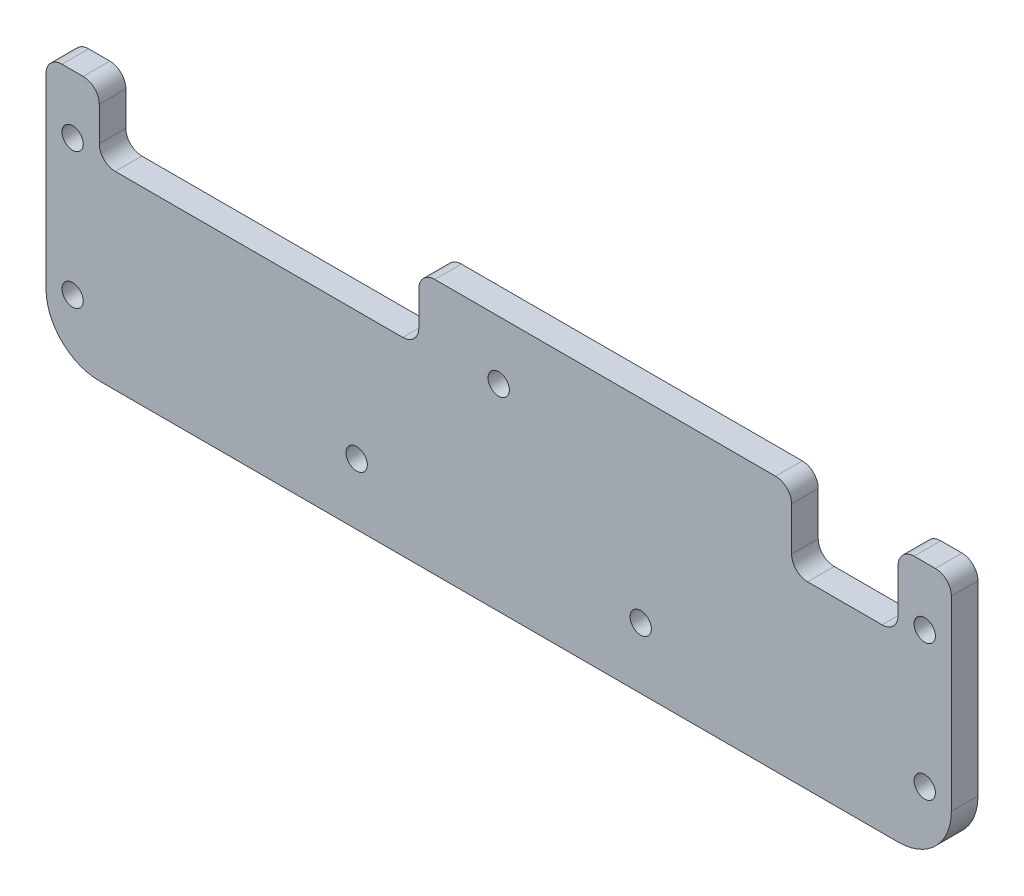
ISO-10303-21;
HEADER;
FILE_DESCRIPTION(('STEP AP214'),'2;1');
FILE_NAME('part.step','',(''),(''),'','','');
FILE_SCHEMA(('AUTOMOTIVE_DESIGN { 1 0 10303 214 1 1 1 1 }'));
ENDSEC;
DATA;
#1=APPLICATION_CONTEXT('core data for automotive mechanical design processes');
#2=APPLICATION_PROTOCOL_DEFINITION('international standard','automotive_design',2000,#1);
#3=PRODUCT_CONTEXT('',#1,'mechanical');
#4=PRODUCT('Part','Part','',(#3));
#5=PRODUCT_RELATED_PRODUCT_CATEGORY('part','',(#4));
#6=PRODUCT_DEFINITION_FORMATION('','',#4);
#7=PRODUCT_DEFINITION_CONTEXT('part definition',#1,'design');
#8=PRODUCT_DEFINITION('design','',#6,#7);
#9=PRODUCT_DEFINITION_SHAPE('','',#8);
#10=(LENGTH_UNIT() NAMED_UNIT(*) SI_UNIT(.MILLI.,.METRE.));
#11=(NAMED_UNIT(*) PLANE_ANGLE_UNIT() SI_UNIT($,.RADIAN.));
#12=(NAMED_UNIT(*) SI_UNIT($,.STERADIAN.) SOLID_ANGLE_UNIT());
#13=UNCERTAINTY_MEASURE_WITH_UNIT(LENGTH_MEASURE(1.E-05),#10,'distance_accuracy_value','');
#14=(GEOMETRIC_REPRESENTATION_CONTEXT(3) GLOBAL_UNCERTAINTY_ASSIGNED_CONTEXT((#13)) GLOBAL_UNIT_ASSIGNED_CONTEXT((#10,
#11,#12)) REPRESENTATION_CONTEXT('',''));
#15=CARTESIAN_POINT('',(0.,0.,0.));
#16=DIRECTION('',(0.,0.,1.));
#17=DIRECTION('',(1.,0.,0.));
#18=AXIS2_PLACEMENT_3D('',#15,#16,#17);
#19=CARTESIAN_POINT('',(-75.,-38.,5.));
#20=DIRECTION('',(0.,0.,-1.));
#21=DIRECTION('',(-1.,0.,0.));
#22=AXIS2_PLACEMENT_3D('',#19,#20,#21);
#23=PLANE('',#22);
#24=CARTESIAN_POINT('',(-26.6666666666667,-36.5,5.));
#25=DIRECTION('',(0.,0.,1.));
#26=DIRECTION('',(1.,0.,0.));
#27=AXIS2_PLACEMENT_3D('',#24,#25,#26);
#28=CIRCLE('',#27,2.00000000000001);
#29=CARTESIAN_POINT('',(-24.6666666666667,-36.5,5.));
#30=VERTEX_POINT('',#29);
#31=EDGE_CURVE('E380',#30,#30,#28,.T.);
#32=ORIENTED_EDGE('',*,*,#31,.F.);
#33=EDGE_LOOP('',(#32));
#34=FACE_BOUND('',#33,.T.);
#35=CARTESIAN_POINT('',(-80.,-11.,5.));
#36=DIRECTION('',(0.,0.,1.));
#37=DIRECTION('',(1.,0.,0.));
#38=AXIS2_PLACEMENT_3D('',#35,#36,#37);
#39=CIRCLE('',#38,2.);
#40=CARTESIAN_POINT('',(-78.,-11.,5.));
#41=VERTEX_POINT('',#40);
#42=EDGE_CURVE('E374',#41,#41,#39,.T.);
#43=ORIENTED_EDGE('',*,*,#42,.F.);
#44=EDGE_LOOP('',(#43));
#45=FACE_BOUND('',#44,.T.);
#46=CARTESIAN_POINT('',(0.,-11.,5.));
#47=DIRECTION('',(0.,0.,1.));
#48=DIRECTION('',(1.,0.,0.));
#49=AXIS2_PLACEMENT_3D('',#46,#47,#48);
#50=CIRCLE('',#49,2.);
#51=CARTESIAN_POINT('',(2.00000000000001,-11.,5.));
#52=VERTEX_POINT('',#51);
#53=EDGE_CURVE('E368',#52,#52,#50,.T.);
#54=ORIENTED_EDGE('',*,*,#53,.F.);
#55=EDGE_LOOP('',(#54));
#56=FACE_BOUND('',#55,.T.);
#57=CARTESIAN_POINT('',(80.,-11.,5.));
#58=DIRECTION('',(0.,0.,1.));
#59=DIRECTION('',(1.,0.,0.));
#60=AXIS2_PLACEMENT_3D('',#57,#58,#59);
#61=CIRCLE('',#60,2.);
#62=CARTESIAN_POINT('',(82.,-11.,5.));
#63=VERTEX_POINT('',#62);
#64=EDGE_CURVE('E362',#63,#63,#61,.T.);
#65=ORIENTED_EDGE('',*,*,#64,.F.);
#66=EDGE_LOOP('',(#65));
#67=FACE_BOUND('',#66,.T.);
#68=CARTESIAN_POINT('',(-80.,-36.5,5.));
#69=DIRECTION('',(0.,0.,1.));
#70=DIRECTION('',(1.,0.,0.));
#71=AXIS2_PLACEMENT_3D('',#68,#69,#70);
#72=CIRCLE('',#71,2.);
#73=CARTESIAN_POINT('',(-78.,-36.5,5.));
#74=VERTEX_POINT('',#73);
#75=EDGE_CURVE('E356',#74,#74,#72,.T.);
#76=ORIENTED_EDGE('',*,*,#75,.F.);
#77=EDGE_LOOP('',(#76));
#78=FACE_BOUND('',#77,.T.);
#79=CARTESIAN_POINT('',(26.6666666666667,-36.5,5.));
#80=DIRECTION('',(0.,0.,1.));
#81=DIRECTION('',(-1.,0.,0.));
#82=AXIS2_PLACEMENT_3D('',#79,#80,#81);
#83=CIRCLE('',#82,2.00000000000001);
#84=CARTESIAN_POINT('',(24.6666666666667,-36.5,5.));
#85=VERTEX_POINT('',#84);
#86=EDGE_CURVE('E350',#85,#85,#83,.T.);
#87=ORIENTED_EDGE('',*,*,#86,.F.);
#88=EDGE_LOOP('',(#87));
#89=FACE_BOUND('',#88,.T.);
#90=CARTESIAN_POINT('',(80.,-36.5,5.));
#91=DIRECTION('',(0.,0.,1.));
#92=DIRECTION('',(1.,0.,0.));
#93=AXIS2_PLACEMENT_3D('',#90,#91,#92);
#94=CIRCLE('',#93,2.);
#95=CARTESIAN_POINT('',(82.,-36.5,5.));
#96=VERTEX_POINT('',#95);
#97=EDGE_CURVE('E341',#96,#96,#94,.T.);
#98=ORIENTED_EDGE('',*,*,#97,.F.);
#99=EDGE_LOOP('',(#98));
#100=FACE_BOUND('',#99,.T.);
#101=DIRECTION('',(0.,-1.,0.));
#102=VECTOR('',#101,1.);
#103=CARTESIAN_POINT('',(55.,-38.,5.));
#104=LINE('',#103,#102);
#105=CARTESIAN_POINT('',(55.,-2.99999999999997,5.));
#106=VERTEX_POINT('',#105);
#107=CARTESIAN_POINT('',(55.,-11.1694329332956,5.));
#108=VERTEX_POINT('',#107);
#109=EDGE_CURVE('E760',#106,#108,#104,.T.);
#110=ORIENTED_EDGE('',*,*,#109,.F.);
#111=CARTESIAN_POINT('',(52.,-2.99999999999997,5.));
#112=DIRECTION('',(0.,0.,-1.));
#113=DIRECTION('',(-1.,0.,0.));
#114=AXIS2_PLACEMENT_3D('',#111,#112,#113);
#115=CIRCLE('',#114,3.);
#116=CARTESIAN_POINT('',(52.,0.,5.));
#117=VERTEX_POINT('',#116);
#118=EDGE_CURVE('E249',#106,#117,#115,.F.);
#119=ORIENTED_EDGE('',*,*,#118,.T.);
#120=DIRECTION('',(-1.,0.,0.));
#121=VECTOR('',#120,1.);
#122=CARTESIAN_POINT('',(-85.,0.,5.));
#123=LINE('',#122,#121);
#124=CARTESIAN_POINT('',(-12.,0.,5.));
#125=VERTEX_POINT('',#124);
#126=EDGE_CURVE('E392',#117,#125,#123,.T.);
#127=ORIENTED_EDGE('',*,*,#126,.T.);
#128=CARTESIAN_POINT('',(-12.,-2.99999999999997,5.));
#129=DIRECTION('',(0.,0.,-1.));
#130=DIRECTION('',(-1.,0.,0.));
#131=AXIS2_PLACEMENT_3D('',#128,#129,#130);
#132=CIRCLE('',#131,3.);
#133=CARTESIAN_POINT('',(-15.,-2.99999999999998,5.));
#134=VERTEX_POINT('',#133);
#135=EDGE_CURVE('E240',#125,#134,#132,.F.);
#136=ORIENTED_EDGE('',*,*,#135,.T.);
#137=DIRECTION('',(0.,1.,0.));
#138=VECTOR('',#137,1.);
#139=CARTESIAN_POINT('',(-15.,-38.,5.));
#140=LINE('',#139,#138);
#141=CARTESIAN_POINT('',(-15.,-9.43462469904166,5.));
#142=VERTEX_POINT('',#141);
#143=EDGE_CURVE('E334',#142,#134,#140,.T.);
#144=ORIENTED_EDGE('',*,*,#143,.F.);
#145=CARTESIAN_POINT('',(-18.,-9.43462469904166,5.));
#146=DIRECTION('',(0.,0.,-1.));
#147=DIRECTION('',(-1.,0.,0.));
#148=AXIS2_PLACEMENT_3D('',#145,#146,#147);
#149=CIRCLE('',#148,3.);
#150=CARTESIAN_POINT('',(-18.,-12.4346246990417,5.));
#151=VERTEX_POINT('',#150);
#152=EDGE_CURVE('E11',#142,#151,#149,.T.);
#153=ORIENTED_EDGE('',*,*,#152,.T.);
#154=DIRECTION('',(1.,0.,0.));
#155=VECTOR('',#154,1.);
#156=CARTESIAN_POINT('',(-75.,-12.4346246990417,5.));
#157=LINE('',#156,#155);
#158=CARTESIAN_POINT('',(-72.,-12.4346246990417,5.));
#159=VERTEX_POINT('',#158);
#160=EDGE_CURVE('E332',#159,#151,#157,.T.);
#161=ORIENTED_EDGE('',*,*,#160,.F.);
#162=CARTESIAN_POINT('',(-72.,-9.43462469904166,5.));
#163=DIRECTION('',(0.,0.,-1.));
#164=DIRECTION('',(-1.,0.,0.));
#165=AXIS2_PLACEMENT_3D('',#162,#163,#164);
#166=CIRCLE('',#165,3.);
#167=CARTESIAN_POINT('',(-75.,-9.43462469904166,5.));
#168=VERTEX_POINT('',#167);
#169=EDGE_CURVE('E308',#159,#168,#166,.T.);
#170=ORIENTED_EDGE('',*,*,#169,.T.);
#171=DIRECTION('',(0.,-1.,0.));
#172=VECTOR('',#171,1.);
#173=CARTESIAN_POINT('',(-75.,-38.,5.));
#174=LINE('',#173,#172);
#175=CARTESIAN_POINT('',(-75.,-2.99999999999998,5.));
#176=VERTEX_POINT('',#175);
#177=EDGE_CURVE('E753',#176,#168,#174,.T.);
#178=ORIENTED_EDGE('',*,*,#177,.F.);
#179=CARTESIAN_POINT('',(-78.,-2.99999999999998,5.));
#180=DIRECTION('',(0.,0.,-1.));
#181=DIRECTION('',(-1.,0.,0.));
#182=AXIS2_PLACEMENT_3D('',#179,#180,#181);
#183=CIRCLE('',#182,3.);
#184=CARTESIAN_POINT('',(-78.,0.,5.));
#185=VERTEX_POINT('',#184);
#186=EDGE_CURVE('E242',#176,#185,#183,.F.);
#187=ORIENTED_EDGE('',*,*,#186,.T.);
#188=CARTESIAN_POINT('',(-82.,0.,5.));
#189=VERTEX_POINT('',#188);
#190=EDGE_CURVE('E391',#185,#189,#123,.T.);
#191=ORIENTED_EDGE('',*,*,#190,.T.);
#192=CARTESIAN_POINT('',(-82.,-2.99999999999998,5.));
#193=DIRECTION('',(0.,0.,-1.));
#194=DIRECTION('',(-1.,0.,0.));
#195=AXIS2_PLACEMENT_3D('',#192,#193,#194);
#196=CIRCLE('',#195,3.);
#197=CARTESIAN_POINT('',(-85.,-2.99999999999998,5.));
#198=VERTEX_POINT('',#197);
#199=EDGE_CURVE('E204',#189,#198,#196,.F.);
#200=ORIENTED_EDGE('',*,*,#199,.T.);
#201=DIRECTION('',(0.,-1.,0.));
#202=VECTOR('',#201,1.);
#203=CARTESIAN_POINT('',(-85.,0.,5.));
#204=LINE('',#203,#202);
#205=CARTESIAN_POINT('',(-85.,-38.,5.));
#206=VERTEX_POINT('',#205);
#207=EDGE_CURVE('E197',#198,#206,#204,.T.);
#208=ORIENTED_EDGE('',*,*,#207,.T.);
#209=CARTESIAN_POINT('',(-75.,-38.,5.));
#210=DIRECTION('',(0.,0.,1.));
#211=DIRECTION('',(-1.,0.,0.));
#212=AXIS2_PLACEMENT_3D('',#209,#210,#211);
#213=CIRCLE('',#212,9.99999999999999);
#214=CARTESIAN_POINT('',(-75.,-48.,5.));
#215=VERTEX_POINT('',#214);
#216=EDGE_CURVE('E200',#206,#215,#213,.T.);
#217=ORIENTED_EDGE('',*,*,#216,.T.);
#218=DIRECTION('',(1.,0.,0.));
#219=VECTOR('',#218,1.);
#220=CARTESIAN_POINT('',(-75.,-48.,5.));
#221=LINE('',#220,#219);
#222=CARTESIAN_POINT('',(75.,-48.,5.));
#223=VERTEX_POINT('',#222);
#224=EDGE_CURVE('E218',#215,#223,#221,.T.);
#225=ORIENTED_EDGE('',*,*,#224,.T.);
#226=CARTESIAN_POINT('',(75.,-38.,5.));
#227=DIRECTION('',(0.,0.,1.));
#228=DIRECTION('',(-1.,0.,0.));
#229=AXIS2_PLACEMENT_3D('',#226,#227,#228);
#230=CIRCLE('',#229,10.);
#231=CARTESIAN_POINT('',(85.,-38.,5.));
#232=VERTEX_POINT('',#231);
#233=EDGE_CURVE('E386',#223,#232,#230,.T.);
#234=ORIENTED_EDGE('',*,*,#233,.T.);
#235=DIRECTION('',(0.,1.,0.));
#236=VECTOR('',#235,1.);
#237=CARTESIAN_POINT('',(85.,0.,5.));
#238=LINE('',#237,#236);
#239=CARTESIAN_POINT('',(85.,-2.99999999999997,5.));
#240=VERTEX_POINT('',#239);
#241=EDGE_CURVE('E388',#232,#240,#238,.T.);
#242=ORIENTED_EDGE('',*,*,#241,.T.);
#243=CARTESIAN_POINT('',(82.,-2.99999999999997,5.));
#244=DIRECTION('',(0.,0.,-1.));
#245=DIRECTION('',(-1.,0.,0.));
#246=AXIS2_PLACEMENT_3D('',#243,#244,#245);
#247=CIRCLE('',#246,3.);
#248=CARTESIAN_POINT('',(82.,0.,5.));
#249=VERTEX_POINT('',#248);
#250=EDGE_CURVE('E245',#240,#249,#247,.F.);
#251=ORIENTED_EDGE('',*,*,#250,.T.);
#252=CARTESIAN_POINT('',(78.,0.,5.));
#253=VERTEX_POINT('',#252);
#254=EDGE_CURVE('E395',#249,#253,#123,.T.);
#255=ORIENTED_EDGE('',*,*,#254,.T.);
#256=CARTESIAN_POINT('',(78.,-2.99999999999997,5.));
#257=DIRECTION('',(0.,0.,-1.));
#258=DIRECTION('',(-1.,0.,0.));
#259=AXIS2_PLACEMENT_3D('',#256,#257,#258);
#260=CIRCLE('',#259,3.);
#261=CARTESIAN_POINT('',(75.,-2.99999999999997,5.));
#262=VERTEX_POINT('',#261);
#263=EDGE_CURVE('E247',#253,#262,#260,.F.);
#264=ORIENTED_EDGE('',*,*,#263,.T.);
#265=DIRECTION('',(0.,1.,0.));
#266=VECTOR('',#265,1.);
#267=CARTESIAN_POINT('',(75.,-38.,5.));
#268=LINE('',#267,#266);
#269=CARTESIAN_POINT('',(75.,-11.1694329332956,5.));
#270=VERTEX_POINT('',#269);
#271=EDGE_CURVE('E755',#270,#262,#268,.T.);
#272=ORIENTED_EDGE('',*,*,#271,.F.);
#273=CARTESIAN_POINT('',(72.,-11.1694329332956,5.));
#274=DIRECTION('',(0.,0.,-1.));
#275=DIRECTION('',(-1.,0.,0.));
#276=AXIS2_PLACEMENT_3D('',#273,#274,#275);
#277=CIRCLE('',#276,3.);
#278=CARTESIAN_POINT('',(72.,-14.1694329332956,5.));
#279=VERTEX_POINT('',#278);
#280=EDGE_CURVE('E305',#270,#279,#277,.T.);
#281=ORIENTED_EDGE('',*,*,#280,.T.);
#282=DIRECTION('',(1.,0.,0.));
#283=VECTOR('',#282,1.);
#284=CARTESIAN_POINT('',(-75.,-14.1694329332956,5.));
#285=LINE('',#284,#283);
#286=CARTESIAN_POINT('',(58.,-14.1694329332956,5.));
#287=VERTEX_POINT('',#286);
#288=EDGE_CURVE('E338',#287,#279,#285,.T.);
#289=ORIENTED_EDGE('',*,*,#288,.F.);
#290=CARTESIAN_POINT('',(58.,-11.1694329332956,5.));
#291=DIRECTION('',(0.,0.,-1.));
#292=DIRECTION('',(-1.,0.,0.));
#293=AXIS2_PLACEMENT_3D('',#290,#291,#292);
#294=CIRCLE('',#293,3.);
#295=EDGE_CURVE('E301',#287,#108,#294,.T.);
#296=ORIENTED_EDGE('',*,*,#295,.T.);
#297=EDGE_LOOP('',(#110,#119,#127,#136,#144,#153,#161,#170,#178,#187,#191,#200,#208,#217,#225,
#234,#242,#251,#255,#264,#272,#281,#289,#296));
#298=FACE_BOUND('',#297,.T.);
#299=ADVANCED_FACE('F35',(#34,#45,#56,#67,#78,#89,#100,#298),#23,.F.);
#300=CARTESIAN_POINT('',(-75.,-38.,0.));
#301=DIRECTION('',(0.,0.,-1.));
#302=DIRECTION('',(-1.,0.,0.));
#303=AXIS2_PLACEMENT_3D('',#300,#301,#302);
#304=PLANE('',#303);
#305=CARTESIAN_POINT('',(26.6666666666667,-36.5,0.));
#306=DIRECTION('',(0.,0.,1.));
#307=DIRECTION('',(-1.,0.,0.));
#308=AXIS2_PLACEMENT_3D('',#305,#306,#307);
#309=CIRCLE('',#308,2.00000000000001);
#310=CARTESIAN_POINT('',(24.6666666666667,-36.5,0.));
#311=VERTEX_POINT('',#310);
#312=EDGE_CURVE('E348',#311,#311,#309,.T.);
#313=ORIENTED_EDGE('',*,*,#312,.T.);
#314=EDGE_LOOP('',(#313));
#315=FACE_BOUND('',#314,.T.);
#316=CARTESIAN_POINT('',(80.,-11.,0.));
#317=DIRECTION('',(0.,0.,1.));
#318=DIRECTION('',(1.,0.,0.));
#319=AXIS2_PLACEMENT_3D('',#316,#317,#318);
#320=CIRCLE('',#319,2.);
#321=CARTESIAN_POINT('',(82.,-11.,0.));
#322=VERTEX_POINT('',#321);
#323=EDGE_CURVE('E359',#322,#322,#320,.T.);
#324=ORIENTED_EDGE('',*,*,#323,.T.);
#325=EDGE_LOOP('',(#324));
#326=FACE_BOUND('',#325,.T.);
#327=CARTESIAN_POINT('',(-80.,-11.,0.));
#328=DIRECTION('',(0.,0.,1.));
#329=DIRECTION('',(1.,0.,0.));
#330=AXIS2_PLACEMENT_3D('',#327,#328,#329);
#331=CIRCLE('',#330,2.);
#332=CARTESIAN_POINT('',(-78.,-11.,0.));
#333=VERTEX_POINT('',#332);
#334=EDGE_CURVE('E371',#333,#333,#331,.T.);
#335=ORIENTED_EDGE('',*,*,#334,.T.);
#336=EDGE_LOOP('',(#335));
#337=FACE_BOUND('',#336,.T.);
#338=CARTESIAN_POINT('',(-26.6666666666667,-36.5,0.));
#339=DIRECTION('',(0.,0.,1.));
#340=DIRECTION('',(1.,0.,0.));
#341=AXIS2_PLACEMENT_3D('',#338,#339,#340);
#342=CIRCLE('',#341,2.00000000000001);
#343=CARTESIAN_POINT('',(-24.6666666666667,-36.5,0.));
#344=VERTEX_POINT('',#343);
#345=EDGE_CURVE('E377',#344,#344,#342,.T.);
#346=ORIENTED_EDGE('',*,*,#345,.T.);
#347=EDGE_LOOP('',(#346));
#348=FACE_BOUND('',#347,.T.);
#349=CARTESIAN_POINT('',(0.,-11.,0.));
#350=DIRECTION('',(0.,0.,1.));
#351=DIRECTION('',(1.,0.,0.));
#352=AXIS2_PLACEMENT_3D('',#349,#350,#351);
#353=CIRCLE('',#352,2.);
#354=CARTESIAN_POINT('',(2.00000000000001,-11.,0.));
#355=VERTEX_POINT('',#354);
#356=EDGE_CURVE('E365',#355,#355,#353,.T.);
#357=ORIENTED_EDGE('',*,*,#356,.T.);
#358=EDGE_LOOP('',(#357));
#359=FACE_BOUND('',#358,.T.);
#360=CARTESIAN_POINT('',(-80.,-36.5,0.));
#361=DIRECTION('',(0.,0.,1.));
#362=DIRECTION('',(1.,0.,0.));
#363=AXIS2_PLACEMENT_3D('',#360,#361,#362);
#364=CIRCLE('',#363,2.);
#365=CARTESIAN_POINT('',(-78.,-36.5,0.));
#366=VERTEX_POINT('',#365);
#367=EDGE_CURVE('E353',#366,#366,#364,.T.);
#368=ORIENTED_EDGE('',*,*,#367,.T.);
#369=EDGE_LOOP('',(#368));
#370=FACE_BOUND('',#369,.T.);
#371=CARTESIAN_POINT('',(80.,-36.5,0.));
#372=DIRECTION('',(0.,0.,1.));
#373=DIRECTION('',(1.,0.,0.));
#374=AXIS2_PLACEMENT_3D('',#371,#372,#373);
#375=CIRCLE('',#374,2.);
#376=CARTESIAN_POINT('',(82.,-36.5,0.));
#377=VERTEX_POINT('',#376);
#378=EDGE_CURVE('E337',#377,#377,#375,.T.);
#379=ORIENTED_EDGE('',*,*,#378,.T.);
#380=EDGE_LOOP('',(#379));
#381=FACE_BOUND('',#380,.T.);
#382=DIRECTION('',(-1.,0.,0.));
#383=VECTOR('',#382,1.);
#384=CARTESIAN_POINT('',(-85.,0.,0.));
#385=LINE('',#384,#383);
#386=CARTESIAN_POINT('',(52.,0.,0.));
#387=VERTEX_POINT('',#386);
#388=CARTESIAN_POINT('',(-12.,0.,0.));
#389=VERTEX_POINT('',#388);
#390=EDGE_CURVE('E409',#387,#389,#385,.T.);
#391=ORIENTED_EDGE('',*,*,#390,.F.);
#392=CARTESIAN_POINT('',(52.,-2.99999999999997,0.));
#393=DIRECTION('',(0.,0.,-1.));
#394=DIRECTION('',(-1.,0.,0.));
#395=AXIS2_PLACEMENT_3D('',#392,#393,#394);
#396=CIRCLE('',#395,3.);
#397=CARTESIAN_POINT('',(55.,-2.99999999999997,0.));
#398=VERTEX_POINT('',#397);
#399=EDGE_CURVE('E264',#387,#398,#396,.T.);
#400=ORIENTED_EDGE('',*,*,#399,.T.);
#401=DIRECTION('',(0.,-1.,0.));
#402=VECTOR('',#401,1.);
#403=CARTESIAN_POINT('',(55.,4.04000759053313,0.));
#404=LINE('',#403,#402);
#405=CARTESIAN_POINT('',(55.,-11.1694329332956,0.));
#406=VERTEX_POINT('',#405);
#407=EDGE_CURVE('E765',#398,#406,#404,.T.);
#408=ORIENTED_EDGE('',*,*,#407,.T.);
#409=CARTESIAN_POINT('',(58.,-11.1694329332956,0.));
#410=DIRECTION('',(0.,0.,-1.));
#411=DIRECTION('',(-1.,0.,0.));
#412=AXIS2_PLACEMENT_3D('',#409,#410,#411);
#413=CIRCLE('',#412,3.);
#414=CARTESIAN_POINT('',(58.,-14.1694329332956,0.));
#415=VERTEX_POINT('',#414);
#416=EDGE_CURVE('E299',#406,#415,#413,.F.);
#417=ORIENTED_EDGE('',*,*,#416,.T.);
#418=DIRECTION('',(1.,0.,0.));
#419=VECTOR('',#418,1.);
#420=CARTESIAN_POINT('',(75.,-14.1694329332956,0.));
#421=LINE('',#420,#419);
#422=CARTESIAN_POINT('',(72.,-14.1694329332956,0.));
#423=VERTEX_POINT('',#422);
#424=EDGE_CURVE('E326',#415,#423,#421,.T.);
#425=ORIENTED_EDGE('',*,*,#424,.T.);
#426=CARTESIAN_POINT('',(72.,-11.1694329332956,0.));
#427=DIRECTION('',(0.,0.,-1.));
#428=DIRECTION('',(-1.,0.,0.));
#429=AXIS2_PLACEMENT_3D('',#426,#427,#428);
#430=CIRCLE('',#429,3.);
#431=CARTESIAN_POINT('',(75.,-11.1694329332956,0.));
#432=VERTEX_POINT('',#431);
#433=EDGE_CURVE('E303',#423,#432,#430,.F.);
#434=ORIENTED_EDGE('',*,*,#433,.T.);
#435=DIRECTION('',(0.,1.,0.));
#436=VECTOR('',#435,1.);
#437=CARTESIAN_POINT('',(75.,4.04000759053314,0.));
#438=LINE('',#437,#436);
#439=CARTESIAN_POINT('',(75.,-2.99999999999997,0.));
#440=VERTEX_POINT('',#439);
#441=EDGE_CURVE('E768',#432,#440,#438,.T.);
#442=ORIENTED_EDGE('',*,*,#441,.T.);
#443=CARTESIAN_POINT('',(78.,-2.99999999999997,0.));
#444=DIRECTION('',(0.,0.,-1.));
#445=DIRECTION('',(-1.,0.,0.));
#446=AXIS2_PLACEMENT_3D('',#443,#444,#445);
#447=CIRCLE('',#446,3.);
#448=CARTESIAN_POINT('',(78.,0.,0.));
#449=VERTEX_POINT('',#448);
#450=EDGE_CURVE('E262',#440,#449,#447,.T.);
#451=ORIENTED_EDGE('',*,*,#450,.T.);
#452=CARTESIAN_POINT('',(82.,0.,0.));
#453=VERTEX_POINT('',#452);
#454=EDGE_CURVE('E209',#453,#449,#385,.T.);
#455=ORIENTED_EDGE('',*,*,#454,.F.);
#456=CARTESIAN_POINT('',(82.,-2.99999999999997,0.));
#457=DIRECTION('',(0.,0.,-1.));
#458=DIRECTION('',(-1.,0.,0.));
#459=AXIS2_PLACEMENT_3D('',#456,#457,#458);
#460=CIRCLE('',#459,3.);
#461=CARTESIAN_POINT('',(85.,-2.99999999999997,0.));
#462=VERTEX_POINT('',#461);
#463=EDGE_CURVE('E260',#453,#462,#460,.T.);
#464=ORIENTED_EDGE('',*,*,#463,.T.);
#465=DIRECTION('',(0.,1.,0.));
#466=VECTOR('',#465,1.);
#467=CARTESIAN_POINT('',(85.,0.,0.));
#468=LINE('',#467,#466);
#469=CARTESIAN_POINT('',(85.,-38.,0.));
#470=VERTEX_POINT('',#469);
#471=EDGE_CURVE('E403',#470,#462,#468,.T.);
#472=ORIENTED_EDGE('',*,*,#471,.F.);
#473=CARTESIAN_POINT('',(75.,-38.,0.));
#474=DIRECTION('',(0.,0.,1.));
#475=DIRECTION('',(-1.,0.,0.));
#476=AXIS2_PLACEMENT_3D('',#473,#474,#475);
#477=CIRCLE('',#476,10.);
#478=CARTESIAN_POINT('',(75.,-48.,0.));
#479=VERTEX_POINT('',#478);
#480=EDGE_CURVE('E401',#479,#470,#477,.T.);
#481=ORIENTED_EDGE('',*,*,#480,.F.);
#482=DIRECTION('',(1.,0.,0.));
#483=VECTOR('',#482,1.);
#484=CARTESIAN_POINT('',(-75.,-48.,0.));
#485=LINE('',#484,#483);
#486=CARTESIAN_POINT('',(-75.,-48.,0.));
#487=VERTEX_POINT('',#486);
#488=EDGE_CURVE('E399',#487,#479,#485,.T.);
#489=ORIENTED_EDGE('',*,*,#488,.F.);
#490=CARTESIAN_POINT('',(-75.,-38.,0.));
#491=DIRECTION('',(0.,0.,1.));
#492=DIRECTION('',(-1.,0.,0.));
#493=AXIS2_PLACEMENT_3D('',#490,#491,#492);
#494=CIRCLE('',#493,9.99999999999999);
#495=CARTESIAN_POINT('',(-85.,-38.,0.));
#496=VERTEX_POINT('',#495);
#497=EDGE_CURVE('E397',#496,#487,#494,.T.);
#498=ORIENTED_EDGE('',*,*,#497,.F.);
#499=DIRECTION('',(0.,-1.,0.));
#500=VECTOR('',#499,1.);
#501=CARTESIAN_POINT('',(-85.,0.,0.));
#502=LINE('',#501,#500);
#503=CARTESIAN_POINT('',(-85.,-2.99999999999998,0.));
#504=VERTEX_POINT('',#503);
#505=EDGE_CURVE('E222',#504,#496,#502,.T.);
#506=ORIENTED_EDGE('',*,*,#505,.F.);
#507=CARTESIAN_POINT('',(-82.,-2.99999999999998,0.));
#508=DIRECTION('',(0.,0.,-1.));
#509=DIRECTION('',(-1.,0.,0.));
#510=AXIS2_PLACEMENT_3D('',#507,#508,#509);
#511=CIRCLE('',#510,3.);
#512=CARTESIAN_POINT('',(-82.,0.,0.));
#513=VERTEX_POINT('',#512);
#514=EDGE_CURVE('E258',#504,#513,#511,.T.);
#515=ORIENTED_EDGE('',*,*,#514,.T.);
#516=CARTESIAN_POINT('',(-78.,0.,0.));
#517=VERTEX_POINT('',#516);
#518=EDGE_CURVE('E406',#517,#513,#385,.T.);
#519=ORIENTED_EDGE('',*,*,#518,.F.);
#520=CARTESIAN_POINT('',(-78.,-2.99999999999998,0.));
#521=DIRECTION('',(0.,0.,-1.));
#522=DIRECTION('',(-1.,0.,0.));
#523=AXIS2_PLACEMENT_3D('',#520,#521,#522);
#524=CIRCLE('',#523,3.);
#525=CARTESIAN_POINT('',(-75.,-2.99999999999998,0.));
#526=VERTEX_POINT('',#525);
#527=EDGE_CURVE('E58',#517,#526,#524,.T.);
#528=ORIENTED_EDGE('',*,*,#527,.T.);
#529=DIRECTION('',(0.,-1.,0.));
#530=VECTOR('',#529,1.);
#531=CARTESIAN_POINT('',(-75.,12.1434752015528,0.));
#532=LINE('',#531,#530);
#533=CARTESIAN_POINT('',(-75.,-9.43462469904166,0.));
#534=VERTEX_POINT('',#533);
#535=EDGE_CURVE('E325',#526,#534,#532,.T.);
#536=ORIENTED_EDGE('',*,*,#535,.T.);
#537=CARTESIAN_POINT('',(-72.,-9.43462469904166,0.));
#538=DIRECTION('',(0.,0.,-1.));
#539=DIRECTION('',(-1.,0.,0.));
#540=AXIS2_PLACEMENT_3D('',#537,#538,#539);
#541=CIRCLE('',#540,3.);
#542=CARTESIAN_POINT('',(-72.,-12.4346246990417,0.));
#543=VERTEX_POINT('',#542);
#544=EDGE_CURVE('E50',#534,#543,#541,.F.);
#545=ORIENTED_EDGE('',*,*,#544,.T.);
#546=DIRECTION('',(1.,0.,0.));
#547=VECTOR('',#546,1.);
#548=CARTESIAN_POINT('',(-15.,-12.4346246990417,0.));
#549=LINE('',#548,#547);
#550=CARTESIAN_POINT('',(-18.,-12.4346246990417,0.));
#551=VERTEX_POINT('',#550);
#552=EDGE_CURVE('E316',#543,#551,#549,.T.);
#553=ORIENTED_EDGE('',*,*,#552,.T.);
#554=CARTESIAN_POINT('',(-18.,-9.43462469904166,0.));
#555=DIRECTION('',(0.,0.,-1.));
#556=DIRECTION('',(-1.,0.,0.));
#557=AXIS2_PLACEMENT_3D('',#554,#555,#556);
#558=CIRCLE('',#557,3.);
#559=CARTESIAN_POINT('',(-15.,-9.43462469904166,0.));
#560=VERTEX_POINT('',#559);
#561=EDGE_CURVE('E43',#551,#560,#558,.F.);
#562=ORIENTED_EDGE('',*,*,#561,.T.);
#563=DIRECTION('',(0.,1.,0.));
#564=VECTOR('',#563,1.);
#565=CARTESIAN_POINT('',(-15.,12.1434752015528,0.));
#566=LINE('',#565,#564);
#567=CARTESIAN_POINT('',(-15.,-2.99999999999997,0.));
#568=VERTEX_POINT('',#567);
#569=EDGE_CURVE('E314',#560,#568,#566,.T.);
#570=ORIENTED_EDGE('',*,*,#569,.T.);
#571=CARTESIAN_POINT('',(-12.,-2.99999999999997,0.));
#572=DIRECTION('',(0.,0.,-1.));
#573=DIRECTION('',(-1.,0.,0.));
#574=AXIS2_PLACEMENT_3D('',#571,#572,#573);
#575=CIRCLE('',#574,3.);
#576=EDGE_CURVE('E255',#568,#389,#575,.T.);
#577=ORIENTED_EDGE('',*,*,#576,.T.);
#578=EDGE_LOOP('',(#391,#400,#408,#417,#425,#434,#442,#451,#455,#464,#472,#481,#489,#498,#506,
#515,#519,#528,#536,#545,#553,#562,#570,#577));
#579=FACE_BOUND('',#578,.T.);
#580=ADVANCED_FACE('F313',(#315,#326,#337,#348,#359,#370,#381,#579),#304,.T.);
#581=CARTESIAN_POINT('',(-85.,0.,5.));
#582=DIRECTION('',(0.,-1.,0.));
#583=DIRECTION('',(1.,0.,0.));
#584=AXIS2_PLACEMENT_3D('',#581,#582,#583);
#585=PLANE('',#584);
#586=ORIENTED_EDGE('',*,*,#126,.F.);
#587=DIRECTION('',(0.,0.,1.));
#588=VECTOR('',#587,1.);
#589=CARTESIAN_POINT('',(52.,0.,0.));
#590=LINE('',#589,#588);
#591=EDGE_CURVE('E253',#117,#387,#590,.F.);
#592=ORIENTED_EDGE('',*,*,#591,.T.);
#593=ORIENTED_EDGE('',*,*,#390,.T.);
#594=DIRECTION('',(0.,0.,-1.));
#595=VECTOR('',#594,1.);
#596=CARTESIAN_POINT('',(-12.,0.,5.));
#597=LINE('',#596,#595);
#598=EDGE_CURVE('E251',#389,#125,#597,.F.);
#599=ORIENTED_EDGE('',*,*,#598,.T.);
#600=EDGE_LOOP('',(#586,#592,#593,#599));
#601=FACE_BOUND('',#600,.T.);
#602=ADVANCED_FACE('F460',(#601),#585,.F.);
#603=ORIENTED_EDGE('',*,*,#518,.T.);
#604=DIRECTION('',(0.,0.,-1.));
#605=VECTOR('',#604,1.);
#606=CARTESIAN_POINT('',(-82.,0.,5.));
#607=LINE('',#606,#605);
#608=EDGE_CURVE('E282',#513,#189,#607,.F.);
#609=ORIENTED_EDGE('',*,*,#608,.T.);
#610=ORIENTED_EDGE('',*,*,#190,.F.);
#611=DIRECTION('',(0.,0.,1.));
#612=VECTOR('',#611,1.);
#613=CARTESIAN_POINT('',(-78.,0.,0.));
#614=LINE('',#613,#612);
#615=EDGE_CURVE('E280',#185,#517,#614,.F.);
#616=ORIENTED_EDGE('',*,*,#615,.T.);
#617=EDGE_LOOP('',(#603,#609,#610,#616));
#618=FACE_BOUND('',#617,.T.);
#619=ADVANCED_FACE('F471',(#618),#585,.F.);
#620=ORIENTED_EDGE('',*,*,#454,.T.);
#621=DIRECTION('',(0.,0.,-1.));
#622=VECTOR('',#621,1.);
#623=CARTESIAN_POINT('',(78.,0.,5.));
#624=LINE('',#623,#622);
#625=EDGE_CURVE('E274',#449,#253,#624,.F.);
#626=ORIENTED_EDGE('',*,*,#625,.T.);
#627=ORIENTED_EDGE('',*,*,#254,.F.);
#628=DIRECTION('',(0.,0.,-1.));
#629=VECTOR('',#628,1.);
#630=CARTESIAN_POINT('',(82.,0.,5.));
#631=LINE('',#630,#629);
#632=EDGE_CURVE('E271',#249,#453,#631,.T.);
#633=ORIENTED_EDGE('',*,*,#632,.T.);
#634=EDGE_LOOP('',(#620,#626,#627,#633));
#635=FACE_BOUND('',#634,.T.);
#636=ADVANCED_FACE('F436',(#635),#585,.F.);
#637=CARTESIAN_POINT('',(-85.,0.,5.));
#638=DIRECTION('',(1.,0.,0.));
#639=DIRECTION('',(0.,1.,0.));
#640=AXIS2_PLACEMENT_3D('',#637,#638,#639);
#641=PLANE('',#640);
#642=ORIENTED_EDGE('',*,*,#207,.F.);
#643=DIRECTION('',(0.,0.,-1.));
#644=VECTOR('',#643,1.);
#645=CARTESIAN_POINT('',(-85.,-2.99999999999998,5.));
#646=LINE('',#645,#644);
#647=EDGE_CURVE('E278',#198,#504,#646,.T.);
#648=ORIENTED_EDGE('',*,*,#647,.T.);
#649=ORIENTED_EDGE('',*,*,#505,.T.);
#650=DIRECTION('',(0.,0.,-1.));
#651=VECTOR('',#650,1.);
#652=CARTESIAN_POINT('',(-85.,-38.,5.));
#653=LINE('',#652,#651);
#654=EDGE_CURVE('E214',#206,#496,#653,.T.);
#655=ORIENTED_EDGE('',*,*,#654,.F.);
#656=EDGE_LOOP('',(#642,#648,#649,#655));
#657=FACE_BOUND('',#656,.T.);
#658=ADVANCED_FACE('F220',(#657),#641,.F.);
#659=CARTESIAN_POINT('',(-75.,-38.,5.));
#660=DIRECTION('',(0.,0.,-1.));
#661=DIRECTION('',(-1.,0.,0.));
#662=AXIS2_PLACEMENT_3D('',#659,#660,#661);
#663=CYLINDRICAL_SURFACE('',#662,9.99999999999999);
#664=ORIENTED_EDGE('',*,*,#497,.T.);
#665=DIRECTION('',(0.,0.,-1.));
#666=VECTOR('',#665,1.);
#667=CARTESIAN_POINT('',(-75.,-48.,5.));
#668=LINE('',#667,#666);
#669=EDGE_CURVE('E216',#215,#487,#668,.T.);
#670=ORIENTED_EDGE('',*,*,#669,.F.);
#671=ORIENTED_EDGE('',*,*,#216,.F.);
#672=ORIENTED_EDGE('',*,*,#654,.T.);
#673=EDGE_LOOP('',(#664,#670,#671,#672));
#674=FACE_BOUND('',#673,.T.);
#675=ADVANCED_FACE('F213',(#674),#663,.T.);
#676=CARTESIAN_POINT('',(-75.,-48.,5.));
#677=DIRECTION('',(0.,1.,0.));
#678=DIRECTION('',(0.,0.,1.));
#679=AXIS2_PLACEMENT_3D('',#676,#677,#678);
#680=PLANE('',#679);
#681=ORIENTED_EDGE('',*,*,#488,.T.);
#682=DIRECTION('',(0.,0.,-1.));
#683=VECTOR('',#682,1.);
#684=CARTESIAN_POINT('',(75.,-48.,5.));
#685=LINE('',#684,#683);
#686=EDGE_CURVE('E229',#223,#479,#685,.T.);
#687=ORIENTED_EDGE('',*,*,#686,.F.);
#688=ORIENTED_EDGE('',*,*,#224,.F.);
#689=ORIENTED_EDGE('',*,*,#669,.T.);
#690=EDGE_LOOP('',(#681,#687,#688,#689));
#691=FACE_BOUND('',#690,.T.);
#692=ADVANCED_FACE('F445',(#691),#680,.F.);
#693=CARTESIAN_POINT('',(75.,-38.,5.));
#694=DIRECTION('',(0.,0.,-1.));
#695=DIRECTION('',(-1.,0.,0.));
#696=AXIS2_PLACEMENT_3D('',#693,#694,#695);
#697=CYLINDRICAL_SURFACE('',#696,10.);
#698=ORIENTED_EDGE('',*,*,#480,.T.);
#699=DIRECTION('',(0.,0.,-1.));
#700=VECTOR('',#699,1.);
#701=CARTESIAN_POINT('',(85.,-38.,5.));
#702=LINE('',#701,#700);
#703=EDGE_CURVE('E410',#232,#470,#702,.T.);
#704=ORIENTED_EDGE('',*,*,#703,.F.);
#705=ORIENTED_EDGE('',*,*,#233,.F.);
#706=ORIENTED_EDGE('',*,*,#686,.T.);
#707=EDGE_LOOP('',(#698,#704,#705,#706));
#708=FACE_BOUND('',#707,.T.);
#709=ADVANCED_FACE('F417',(#708),#697,.T.);
#710=CARTESIAN_POINT('',(85.,0.,5.));
#711=DIRECTION('',(-1.,0.,0.));
#712=DIRECTION('',(0.,0.,1.));
#713=AXIS2_PLACEMENT_3D('',#710,#711,#712);
#714=PLANE('',#713);
#715=ORIENTED_EDGE('',*,*,#471,.T.);
#716=DIRECTION('',(0.,0.,-1.));
#717=VECTOR('',#716,1.);
#718=CARTESIAN_POINT('',(85.,-2.99999999999997,5.));
#719=LINE('',#718,#717);
#720=EDGE_CURVE('E276',#462,#240,#719,.F.);
#721=ORIENTED_EDGE('',*,*,#720,.T.);
#722=ORIENTED_EDGE('',*,*,#241,.F.);
#723=ORIENTED_EDGE('',*,*,#703,.T.);
#724=EDGE_LOOP('',(#715,#721,#722,#723));
#725=FACE_BOUND('',#724,.T.);
#726=ADVANCED_FACE('F425',(#725),#714,.F.);
#727=CARTESIAN_POINT('',(-26.6666666666667,-36.5,5.));
#728=DIRECTION('',(0.,0.,-1.));
#729=DIRECTION('',(-1.,0.,0.));
#730=AXIS2_PLACEMENT_3D('',#727,#728,#729);
#731=CYLINDRICAL_SURFACE('',#730,2.00000000000001);
#732=ORIENTED_EDGE('',*,*,#31,.T.);
#733=EDGE_LOOP('',(#732));
#734=FACE_BOUND('',#733,.T.);
#735=ORIENTED_EDGE('',*,*,#345,.F.);
#736=EDGE_LOOP('',(#735));
#737=FACE_BOUND('',#736,.T.);
#738=ADVANCED_FACE('F466',(#734,#737),#731,.F.);
#739=CARTESIAN_POINT('',(-80.,-11.,5.));
#740=DIRECTION('',(0.,0.,-1.));
#741=DIRECTION('',(-1.,0.,0.));
#742=AXIS2_PLACEMENT_3D('',#739,#740,#741);
#743=CYLINDRICAL_SURFACE('',#742,2.);
#744=ORIENTED_EDGE('',*,*,#42,.T.);
#745=EDGE_LOOP('',(#744));
#746=FACE_BOUND('',#745,.T.);
#747=ORIENTED_EDGE('',*,*,#334,.F.);
#748=EDGE_LOOP('',(#747));
#749=FACE_BOUND('',#748,.T.);
#750=ADVANCED_FACE('F477',(#746,#749),#743,.F.);
#751=CARTESIAN_POINT('',(0.,-11.,5.));
#752=DIRECTION('',(0.,0.,-1.));
#753=DIRECTION('',(-1.,0.,0.));
#754=AXIS2_PLACEMENT_3D('',#751,#752,#753);
#755=CYLINDRICAL_SURFACE('',#754,2.);
#756=ORIENTED_EDGE('',*,*,#53,.T.);
#757=EDGE_LOOP('',(#756));
#758=FACE_BOUND('',#757,.T.);
#759=ORIENTED_EDGE('',*,*,#356,.F.);
#760=EDGE_LOOP('',(#759));
#761=FACE_BOUND('',#760,.T.);
#762=ADVANCED_FACE('F482',(#758,#761),#755,.F.);
#763=CARTESIAN_POINT('',(80.,-11.,5.));
#764=DIRECTION('',(0.,0.,-1.));
#765=DIRECTION('',(-1.,0.,0.));
#766=AXIS2_PLACEMENT_3D('',#763,#764,#765);
#767=CYLINDRICAL_SURFACE('',#766,2.);
#768=ORIENTED_EDGE('',*,*,#64,.T.);
#769=EDGE_LOOP('',(#768));
#770=FACE_BOUND('',#769,.T.);
#771=ORIENTED_EDGE('',*,*,#323,.F.);
#772=EDGE_LOOP('',(#771));
#773=FACE_BOUND('',#772,.T.);
#774=ADVANCED_FACE('F515',(#770,#773),#767,.F.);
#775=CARTESIAN_POINT('',(-80.,-36.5,5.));
#776=DIRECTION('',(0.,0.,-1.));
#777=DIRECTION('',(-1.,0.,0.));
#778=AXIS2_PLACEMENT_3D('',#775,#776,#777);
#779=CYLINDRICAL_SURFACE('',#778,2.);
#780=ORIENTED_EDGE('',*,*,#75,.T.);
#781=EDGE_LOOP('',(#780));
#782=FACE_BOUND('',#781,.T.);
#783=ORIENTED_EDGE('',*,*,#367,.F.);
#784=EDGE_LOOP('',(#783));
#785=FACE_BOUND('',#784,.T.);
#786=ADVANCED_FACE('F507',(#782,#785),#779,.F.);
#787=CARTESIAN_POINT('',(26.6666666666667,-36.5,5.));
#788=DIRECTION('',(0.,0.,-1.));
#789=DIRECTION('',(-1.,0.,0.));
#790=AXIS2_PLACEMENT_3D('',#787,#788,#789);
#791=CYLINDRICAL_SURFACE('',#790,2.00000000000001);
#792=ORIENTED_EDGE('',*,*,#86,.T.);
#793=EDGE_LOOP('',(#792));
#794=FACE_BOUND('',#793,.T.);
#795=ORIENTED_EDGE('',*,*,#312,.F.);
#796=EDGE_LOOP('',(#795));
#797=FACE_BOUND('',#796,.T.);
#798=ADVANCED_FACE('F497',(#794,#797),#791,.F.);
#799=CARTESIAN_POINT('',(80.,-36.5,5.));
#800=DIRECTION('',(0.,0.,-1.));
#801=DIRECTION('',(-1.,0.,0.));
#802=AXIS2_PLACEMENT_3D('',#799,#800,#801);
#803=CYLINDRICAL_SURFACE('',#802,2.);
#804=ORIENTED_EDGE('',*,*,#97,.T.);
#805=EDGE_LOOP('',(#804));
#806=FACE_BOUND('',#805,.T.);
#807=ORIENTED_EDGE('',*,*,#378,.F.);
#808=EDGE_LOOP('',(#807));
#809=FACE_BOUND('',#808,.T.);
#810=ADVANCED_FACE('F494',(#806,#809),#803,.F.);
#811=CARTESIAN_POINT('',(75.,-14.1694329332956,29.));
#812=DIRECTION('',(0.,1.,0.));
#813=DIRECTION('',(-1.,0.,0.));
#814=AXIS2_PLACEMENT_3D('',#811,#812,#813);
#815=PLANE('',#814);
#816=ORIENTED_EDGE('',*,*,#424,.F.);
#817=DIRECTION('',(0.,0.,-1.));
#818=VECTOR('',#817,1.);
#819=CARTESIAN_POINT('',(58.,-14.1694329332956,5.00000000000001));
#820=LINE('',#819,#818);
#821=EDGE_CURVE('E238',#415,#287,#820,.F.);
#822=ORIENTED_EDGE('',*,*,#821,.T.);
#823=ORIENTED_EDGE('',*,*,#288,.T.);
#824=DIRECTION('',(0.,0.,-1.));
#825=VECTOR('',#824,1.);
#826=CARTESIAN_POINT('',(72.,-14.1694329332956,0.));
#827=LINE('',#826,#825);
#828=EDGE_CURVE('E235',#279,#423,#827,.T.);
#829=ORIENTED_EDGE('',*,*,#828,.T.);
#830=EDGE_LOOP('',(#816,#822,#823,#829));
#831=FACE_BOUND('',#830,.T.);
#832=ADVANCED_FACE('F496',(#831),#815,.T.);
#833=CARTESIAN_POINT('',(75.,4.04000759053314,29.));
#834=DIRECTION('',(-1.,0.,0.));
#835=DIRECTION('',(0.,0.,1.));
#836=AXIS2_PLACEMENT_3D('',#833,#834,#835);
#837=PLANE('',#836);
#838=ORIENTED_EDGE('',*,*,#441,.F.);
#839=DIRECTION('',(0.,0.,-1.));
#840=VECTOR('',#839,1.);
#841=CARTESIAN_POINT('',(75.,-11.1694329332956,5.00000000000001));
#842=LINE('',#841,#840);
#843=EDGE_CURVE('E269',#432,#270,#842,.F.);
#844=ORIENTED_EDGE('',*,*,#843,.T.);
#845=ORIENTED_EDGE('',*,*,#271,.T.);
#846=DIRECTION('',(0.,0.,-1.));
#847=VECTOR('',#846,1.);
#848=CARTESIAN_POINT('',(75.,-2.99999999999997,0.));
#849=LINE('',#848,#847);
#850=EDGE_CURVE('E266',#262,#440,#849,.T.);
#851=ORIENTED_EDGE('',*,*,#850,.T.);
#852=EDGE_LOOP('',(#838,#844,#845,#851));
#853=FACE_BOUND('',#852,.T.);
#854=ADVANCED_FACE('F504',(#853),#837,.T.);
#855=CARTESIAN_POINT('',(55.,4.04000759053313,29.));
#856=DIRECTION('',(1.,0.,0.));
#857=DIRECTION('',(0.,0.,-1.));
#858=AXIS2_PLACEMENT_3D('',#855,#856,#857);
#859=PLANE('',#858);
#860=ORIENTED_EDGE('',*,*,#109,.T.);
#861=DIRECTION('',(0.,0.,-1.));
#862=VECTOR('',#861,1.);
#863=CARTESIAN_POINT('',(55.,-11.1694329332956,0.));
#864=LINE('',#863,#862);
#865=EDGE_CURVE('E227',#108,#406,#864,.T.);
#866=ORIENTED_EDGE('',*,*,#865,.T.);
#867=ORIENTED_EDGE('',*,*,#407,.F.);
#868=DIRECTION('',(0.,0.,1.));
#869=VECTOR('',#868,1.);
#870=CARTESIAN_POINT('',(55.,-2.99999999999997,5.));
#871=LINE('',#870,#869);
#872=EDGE_CURVE('E224',#398,#106,#871,.T.);
#873=ORIENTED_EDGE('',*,*,#872,.T.);
#874=EDGE_LOOP('',(#860,#866,#867,#873));
#875=FACE_BOUND('',#874,.T.);
#876=ADVANCED_FACE('F622',(#875),#859,.T.);
#877=CARTESIAN_POINT('',(-15.,-12.4346246990417,29.));
#878=DIRECTION('',(0.,1.,0.));
#879=DIRECTION('',(-1.,0.,0.));
#880=AXIS2_PLACEMENT_3D('',#877,#878,#879);
#881=PLANE('',#880);
#882=ORIENTED_EDGE('',*,*,#552,.F.);
#883=DIRECTION('',(0.,0.,-1.));
#884=VECTOR('',#883,1.);
#885=CARTESIAN_POINT('',(-72.,-12.4346246990417,5.00000000000001));
#886=LINE('',#885,#884);
#887=EDGE_CURVE('E292',#543,#159,#886,.F.);
#888=ORIENTED_EDGE('',*,*,#887,.T.);
#889=ORIENTED_EDGE('',*,*,#160,.T.);
#890=DIRECTION('',(0.,0.,-1.));
#891=VECTOR('',#890,1.);
#892=CARTESIAN_POINT('',(-18.,-12.4346246990417,0.));
#893=LINE('',#892,#891);
#894=EDGE_CURVE('E289',#151,#551,#893,.T.);
#895=ORIENTED_EDGE('',*,*,#894,.T.);
#896=EDGE_LOOP('',(#882,#888,#889,#895));
#897=FACE_BOUND('',#896,.T.);
#898=ADVANCED_FACE('F336',(#897),#881,.T.);
#899=CARTESIAN_POINT('',(-15.,12.1434752015528,29.));
#900=DIRECTION('',(-1.,0.,0.));
#901=DIRECTION('',(0.,-1.,0.));
#902=AXIS2_PLACEMENT_3D('',#899,#900,#901);
#903=PLANE('',#902);
#904=ORIENTED_EDGE('',*,*,#569,.F.);
#905=DIRECTION('',(0.,0.,-1.));
#906=VECTOR('',#905,1.);
#907=CARTESIAN_POINT('',(-15.,-9.43462469904166,5.00000000000001));
#908=LINE('',#907,#906);
#909=EDGE_CURVE('E297',#560,#142,#908,.F.);
#910=ORIENTED_EDGE('',*,*,#909,.T.);
#911=ORIENTED_EDGE('',*,*,#143,.T.);
#912=DIRECTION('',(0.,0.,-1.));
#913=VECTOR('',#912,1.);
#914=CARTESIAN_POINT('',(-15.,-2.99999999999997,0.));
#915=LINE('',#914,#913);
#916=EDGE_CURVE('E294',#134,#568,#915,.T.);
#917=ORIENTED_EDGE('',*,*,#916,.T.);
#918=EDGE_LOOP('',(#904,#910,#911,#917));
#919=FACE_BOUND('',#918,.T.);
#920=ADVANCED_FACE('F321',(#919),#903,.T.);
#921=CARTESIAN_POINT('',(-75.,12.1434752015528,29.));
#922=DIRECTION('',(1.,0.,0.));
#923=DIRECTION('',(0.,0.,-1.));
#924=AXIS2_PLACEMENT_3D('',#921,#922,#923);
#925=PLANE('',#924);
#926=ORIENTED_EDGE('',*,*,#535,.F.);
#927=DIRECTION('',(0.,0.,1.));
#928=VECTOR('',#927,1.);
#929=CARTESIAN_POINT('',(-75.,-2.99999999999998,5.));
#930=LINE('',#929,#928);
#931=EDGE_CURVE('E286',#526,#176,#930,.T.);
#932=ORIENTED_EDGE('',*,*,#931,.T.);
#933=ORIENTED_EDGE('',*,*,#177,.T.);
#934=DIRECTION('',(0.,0.,-1.));
#935=VECTOR('',#934,1.);
#936=CARTESIAN_POINT('',(-75.,-9.43462469904166,0.));
#937=LINE('',#936,#935);
#938=EDGE_CURVE('E284',#168,#534,#937,.T.);
#939=ORIENTED_EDGE('',*,*,#938,.T.);
#940=EDGE_LOOP('',(#926,#932,#933,#939));
#941=FACE_BOUND('',#940,.T.);
#942=ADVANCED_FACE('F647',(#941),#925,.T.);
#943=CARTESIAN_POINT('',(58.,-11.1694329332956,29.));
#944=DIRECTION('',(0.,0.,1.));
#945=DIRECTION('',(1.,0.,0.));
#946=AXIS2_PLACEMENT_3D('',#943,#944,#945);
#947=CYLINDRICAL_SURFACE('',#946,3.);
#948=ORIENTED_EDGE('',*,*,#295,.F.);
#949=ORIENTED_EDGE('',*,*,#821,.F.);
#950=ORIENTED_EDGE('',*,*,#416,.F.);
#951=ORIENTED_EDGE('',*,*,#865,.F.);
#952=EDGE_LOOP('',(#948,#949,#950,#951));
#953=FACE_BOUND('',#952,.T.);
#954=ADVANCED_FACE('F656',(#953),#947,.F.);
#955=CARTESIAN_POINT('',(52.,-2.99999999999997,29.));
#956=DIRECTION('',(0.,0.,-1.));
#957=DIRECTION('',(-1.,0.,0.));
#958=AXIS2_PLACEMENT_3D('',#955,#956,#957);
#959=CYLINDRICAL_SURFACE('',#958,3.);
#960=ORIENTED_EDGE('',*,*,#399,.F.);
#961=ORIENTED_EDGE('',*,*,#591,.F.);
#962=ORIENTED_EDGE('',*,*,#118,.F.);
#963=ORIENTED_EDGE('',*,*,#872,.F.);
#964=EDGE_LOOP('',(#960,#961,#962,#963));
#965=FACE_BOUND('',#964,.T.);
#966=ADVANCED_FACE('F666',(#965),#959,.T.);
#967=CARTESIAN_POINT('',(72.,-11.1694329332956,29.));
#968=DIRECTION('',(0.,0.,1.));
#969=DIRECTION('',(1.,0.,0.));
#970=AXIS2_PLACEMENT_3D('',#967,#968,#969);
#971=CYLINDRICAL_SURFACE('',#970,3.);
#972=ORIENTED_EDGE('',*,*,#280,.F.);
#973=ORIENTED_EDGE('',*,*,#843,.F.);
#974=ORIENTED_EDGE('',*,*,#433,.F.);
#975=ORIENTED_EDGE('',*,*,#828,.F.);
#976=EDGE_LOOP('',(#972,#973,#974,#975));
#977=FACE_BOUND('',#976,.T.);
#978=ADVANCED_FACE('F676',(#977),#971,.F.);
#979=CARTESIAN_POINT('',(78.,-2.99999999999997,29.));
#980=DIRECTION('',(0.,0.,1.));
#981=DIRECTION('',(1.,0.,0.));
#982=AXIS2_PLACEMENT_3D('',#979,#980,#981);
#983=CYLINDRICAL_SURFACE('',#982,3.);
#984=ORIENTED_EDGE('',*,*,#263,.F.);
#985=ORIENTED_EDGE('',*,*,#625,.F.);
#986=ORIENTED_EDGE('',*,*,#450,.F.);
#987=ORIENTED_EDGE('',*,*,#850,.F.);
#988=EDGE_LOOP('',(#984,#985,#986,#987));
#989=FACE_BOUND('',#988,.T.);
#990=ADVANCED_FACE('F686',(#989),#983,.T.);
#991=CARTESIAN_POINT('',(82.,-2.99999999999997,5.));
#992=DIRECTION('',(0.,0.,-1.));
#993=DIRECTION('',(-1.,0.,0.));
#994=AXIS2_PLACEMENT_3D('',#991,#992,#993);
#995=CYLINDRICAL_SURFACE('',#994,3.);
#996=ORIENTED_EDGE('',*,*,#250,.F.);
#997=ORIENTED_EDGE('',*,*,#720,.F.);
#998=ORIENTED_EDGE('',*,*,#463,.F.);
#999=ORIENTED_EDGE('',*,*,#632,.F.);
#1000=EDGE_LOOP('',(#996,#997,#998,#999));
#1001=FACE_BOUND('',#1000,.T.);
#1002=ADVANCED_FACE('F429',(#1001),#995,.T.);
#1003=CARTESIAN_POINT('',(-82.,-2.99999999999998,5.));
#1004=DIRECTION('',(0.,0.,-1.));
#1005=DIRECTION('',(-1.,0.,0.));
#1006=AXIS2_PLACEMENT_3D('',#1003,#1004,#1005);
#1007=CYLINDRICAL_SURFACE('',#1006,3.);
#1008=ORIENTED_EDGE('',*,*,#199,.F.);
#1009=ORIENTED_EDGE('',*,*,#608,.F.);
#1010=ORIENTED_EDGE('',*,*,#514,.F.);
#1011=ORIENTED_EDGE('',*,*,#647,.F.);
#1012=EDGE_LOOP('',(#1008,#1009,#1010,#1011));
#1013=FACE_BOUND('',#1012,.T.);
#1014=ADVANCED_FACE('F444',(#1013),#1007,.T.);
#1015=CARTESIAN_POINT('',(-78.,-2.99999999999998,29.));
#1016=DIRECTION('',(0.,0.,-1.));
#1017=DIRECTION('',(-1.,0.,0.));
#1018=AXIS2_PLACEMENT_3D('',#1015,#1016,#1017);
#1019=CYLINDRICAL_SURFACE('',#1018,3.);
#1020=ORIENTED_EDGE('',*,*,#527,.F.);
#1021=ORIENTED_EDGE('',*,*,#615,.F.);
#1022=ORIENTED_EDGE('',*,*,#186,.F.);
#1023=ORIENTED_EDGE('',*,*,#931,.F.);
#1024=EDGE_LOOP('',(#1020,#1021,#1022,#1023));
#1025=FACE_BOUND('',#1024,.T.);
#1026=ADVANCED_FACE('F713',(#1025),#1019,.T.);
#1027=CARTESIAN_POINT('',(-72.,-9.43462469904166,29.));
#1028=DIRECTION('',(0.,0.,1.));
#1029=DIRECTION('',(1.,0.,0.));
#1030=AXIS2_PLACEMENT_3D('',#1027,#1028,#1029);
#1031=CYLINDRICAL_SURFACE('',#1030,3.);
#1032=ORIENTED_EDGE('',*,*,#169,.F.);
#1033=ORIENTED_EDGE('',*,*,#887,.F.);
#1034=ORIENTED_EDGE('',*,*,#544,.F.);
#1035=ORIENTED_EDGE('',*,*,#938,.F.);
#1036=EDGE_LOOP('',(#1032,#1033,#1034,#1035));
#1037=FACE_BOUND('',#1036,.T.);
#1038=ADVANCED_FACE('F722',(#1037),#1031,.F.);
#1039=CARTESIAN_POINT('',(-18.,-9.43462469904166,29.));
#1040=DIRECTION('',(0.,0.,1.));
#1041=DIRECTION('',(1.,0.,0.));
#1042=AXIS2_PLACEMENT_3D('',#1039,#1040,#1041);
#1043=CYLINDRICAL_SURFACE('',#1042,3.);
#1044=ORIENTED_EDGE('',*,*,#152,.F.);
#1045=ORIENTED_EDGE('',*,*,#909,.F.);
#1046=ORIENTED_EDGE('',*,*,#561,.F.);
#1047=ORIENTED_EDGE('',*,*,#894,.F.);
#1048=EDGE_LOOP('',(#1044,#1045,#1046,#1047));
#1049=FACE_BOUND('',#1048,.T.);
#1050=ADVANCED_FACE('F329',(#1049),#1043,.F.);
#1051=CARTESIAN_POINT('',(-12.,-2.99999999999997,29.));
#1052=DIRECTION('',(0.,0.,1.));
#1053=DIRECTION('',(1.,0.,0.));
#1054=AXIS2_PLACEMENT_3D('',#1051,#1052,#1053);
#1055=CYLINDRICAL_SURFACE('',#1054,3.);
#1056=ORIENTED_EDGE('',*,*,#135,.F.);
#1057=ORIENTED_EDGE('',*,*,#598,.F.);
#1058=ORIENTED_EDGE('',*,*,#576,.F.);
#1059=ORIENTED_EDGE('',*,*,#916,.F.);
#1060=EDGE_LOOP('',(#1056,#1057,#1058,#1059));
#1061=FACE_BOUND('',#1060,.T.);
#1062=ADVANCED_FACE('F37',(#1061),#1055,.T.);
#1063=CLOSED_SHELL('',(#299,#580,#602,#619,#636,#658,#675,#692,#709,#726,#738,#750,#762,#774,
#786,#798,#810,#832,#854,#876,#898,#920,#942,#954,#966,#978,#990,#1002,#1014,#1026,#1038,#1050,#1062));
#1064=MANIFOLD_SOLID_BREP('B2',#1063);
#1065=ADVANCED_BREP_SHAPE_REPRESENTATION('',(#18,#1064),#14);
#1066=SHAPE_DEFINITION_REPRESENTATION(#9,#1065);
ENDSEC;
END-ISO-10303-21;
